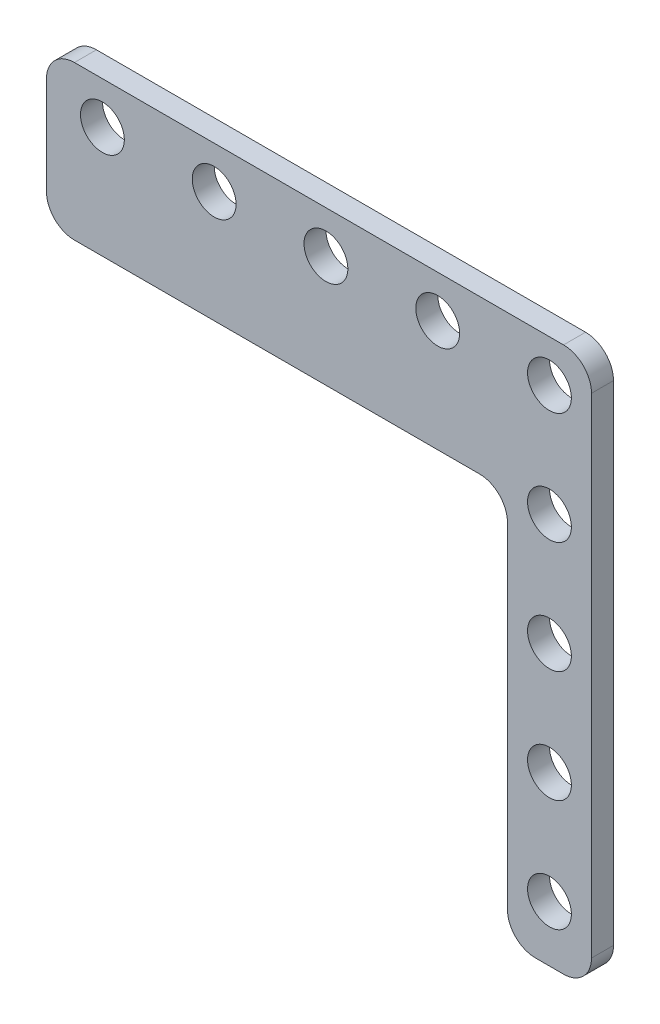
ISO-10303-21;
HEADER;
FILE_DESCRIPTION(('STEP AP214'),'2;1');
FILE_NAME('part.step','',(''),(''),'','','');
FILE_SCHEMA(('AUTOMOTIVE_DESIGN { 1 0 10303 214 1 1 1 1 }'));
ENDSEC;
DATA;
#1=APPLICATION_CONTEXT('core data for automotive mechanical design processes');
#2=APPLICATION_PROTOCOL_DEFINITION('international standard','automotive_design',2000,#1);
#3=PRODUCT_CONTEXT('',#1,'mechanical');
#4=PRODUCT('Part','Part','',(#3));
#5=PRODUCT_RELATED_PRODUCT_CATEGORY('part','',(#4));
#6=PRODUCT_DEFINITION_FORMATION('','',#4);
#7=PRODUCT_DEFINITION_CONTEXT('part definition',#1,'design');
#8=PRODUCT_DEFINITION('design','',#6,#7);
#9=PRODUCT_DEFINITION_SHAPE('','',#8);
#10=(LENGTH_UNIT() NAMED_UNIT(*) SI_UNIT(.MILLI.,.METRE.));
#11=(NAMED_UNIT(*) PLANE_ANGLE_UNIT() SI_UNIT($,.RADIAN.));
#12=(NAMED_UNIT(*) SI_UNIT($,.STERADIAN.) SOLID_ANGLE_UNIT());
#13=UNCERTAINTY_MEASURE_WITH_UNIT(LENGTH_MEASURE(1.E-05),#10,'distance_accuracy_value','');
#14=(GEOMETRIC_REPRESENTATION_CONTEXT(3) GLOBAL_UNCERTAINTY_ASSIGNED_CONTEXT((#13)) GLOBAL_UNIT_ASSIGNED_CONTEXT((#10,
#11,#12)) REPRESENTATION_CONTEXT('',''));
#15=CARTESIAN_POINT('',(0.,0.,0.));
#16=DIRECTION('',(0.,0.,1.));
#17=DIRECTION('',(1.,0.,0.));
#18=AXIS2_PLACEMENT_3D('',#15,#16,#17);
#19=CARTESIAN_POINT('',(17.4752000000032,906.475199999967,1.53492743580445E-13));
#20=DIRECTION('',(0.,1.,0.));
#21=DIRECTION('',(1.,0.,0.));
#22=AXIS2_PLACEMENT_3D('',#19,#20,#21);
#23=PLANE('',#22);
#24=DIRECTION('',(0.,0.,-1.));
#25=VECTOR('',#24,1.);
#26=CARTESIAN_POINT('',(-41.2749999999967,906.475199999967,1.5349987714556E-13));
#27=LINE('',#26,#25);
#28=CARTESIAN_POINT('',(-41.2749999999967,906.475199999967,2.50000000000015));
#29=VERTEX_POINT('',#28);
#30=CARTESIAN_POINT('',(-41.2749999999967,906.475199999967,1.53506279213021E-13));
#31=VERTEX_POINT('',#30);
#32=EDGE_CURVE('E115',#29,#31,#27,.T.);
#33=ORIENTED_EDGE('',*,*,#32,.F.);
#34=DIRECTION('',(-1.,0.,0.));
#35=VECTOR('',#34,1.);
#36=CARTESIAN_POINT('',(17.4752000000032,906.475199999967,2.50000000000015));
#37=LINE('',#36,#35);
#38=CARTESIAN_POINT('',(14.3002000000032,906.475199999967,2.50000000000015));
#39=VERTEX_POINT('',#38);
#40=EDGE_CURVE('E113',#39,#29,#37,.T.);
#41=ORIENTED_EDGE('',*,*,#40,.F.);
#42=DIRECTION('',(0.,0.,1.));
#43=VECTOR('',#42,1.);
#44=CARTESIAN_POINT('',(14.3002000000032,906.475199999967,1.53103754470967E-13));
#45=LINE('',#44,#43);
#46=CARTESIAN_POINT('',(14.3002000000032,906.475199999967,1.53493475078099E-13));
#47=VERTEX_POINT('',#46);
#48=EDGE_CURVE('E11',#47,#39,#45,.T.);
#49=ORIENTED_EDGE('',*,*,#48,.F.);
#50=DIRECTION('',(-1.,0.,0.));
#51=VECTOR('',#50,1.);
#52=CARTESIAN_POINT('',(17.4752000000032,906.475199999967,1.53492743580445E-13));
#53=LINE('',#52,#51);
#54=EDGE_CURVE('E293',#47,#31,#53,.T.);
#55=ORIENTED_EDGE('',*,*,#54,.T.);
#56=EDGE_LOOP('',(#33,#41,#49,#55));
#57=FACE_BOUND('',#56,.T.);
#58=ADVANCED_FACE('F17',(#57),#23,.T.);
#59=CARTESIAN_POINT('',(17.4752000000032,844.549999999967,1.52714765361489E-13));
#60=DIRECTION('',(1.,0.,0.));
#61=DIRECTION('',(0.,1.,0.));
#62=AXIS2_PLACEMENT_3D('',#59,#60,#61);
#63=PLANE('',#62);
#64=DIRECTION('',(0.,0.,1.));
#65=VECTOR('',#64,1.);
#66=CARTESIAN_POINT('',(17.4752000000032,847.724999999967,1.52716778443031E-13));
#67=LINE('',#66,#65);
#68=CARTESIAN_POINT('',(17.4752000000032,847.724999999967,1.52754653498228E-13));
#69=VERTEX_POINT('',#68);
#70=CARTESIAN_POINT('',(17.4752000000032,847.724999999967,2.50000000000015));
#71=VERTEX_POINT('',#70);
#72=EDGE_CURVE('E143',#69,#71,#67,.T.);
#73=ORIENTED_EDGE('',*,*,#72,.F.);
#74=DIRECTION('',(0.,1.,0.));
#75=VECTOR('',#74,1.);
#76=CARTESIAN_POINT('',(17.4752000000032,844.549999999967,1.52714765361489E-13));
#77=LINE('',#76,#75);
#78=CARTESIAN_POINT('',(17.4752000000032,903.300199999967,1.53452855443706E-13));
#79=VERTEX_POINT('',#78);
#80=EDGE_CURVE('E259',#69,#79,#77,.T.);
#81=ORIENTED_EDGE('',*,*,#80,.T.);
#82=DIRECTION('',(0.,0.,-1.));
#83=VECTOR('',#82,1.);
#84=CARTESIAN_POINT('',(17.4752000000032,903.300199999967,1.53103754470967E-13));
#85=LINE('',#84,#83);
#86=CARTESIAN_POINT('',(17.4752000000032,903.300199999967,2.50000000000015));
#87=VERTEX_POINT('',#86);
#88=EDGE_CURVE('E25',#87,#79,#85,.T.);
#89=ORIENTED_EDGE('',*,*,#88,.F.);
#90=DIRECTION('',(0.,1.,0.));
#91=VECTOR('',#90,1.);
#92=CARTESIAN_POINT('',(17.4752000000032,844.549999999967,2.50000000000015));
#93=LINE('',#92,#91);
#94=EDGE_CURVE('E125',#71,#87,#93,.T.);
#95=ORIENTED_EDGE('',*,*,#94,.F.);
#96=EDGE_LOOP('',(#73,#81,#89,#95));
#97=FACE_BOUND('',#96,.T.);
#98=ADVANCED_FACE('F700',(#97),#63,.T.);
#99=CARTESIAN_POINT('',(14.3002000000032,903.300199999967,1.53103754470967E-13));
#100=DIRECTION('',(0.,0.,1.));
#101=DIRECTION('',(0.707106781186552,0.707106781186543,0.));
#102=AXIS2_PLACEMENT_3D('',#99,#100,#101);
#103=CYLINDRICAL_SURFACE('',#102,3.175);
#104=CARTESIAN_POINT('',(14.3002000000032,903.300199999967,2.50000000000015));
#105=DIRECTION('',(0.,0.,-1.));
#106=DIRECTION('',(0.707106781186552,0.707106781186543,0.));
#107=AXIS2_PLACEMENT_3D('',#104,#105,#106);
#108=CIRCLE('',#107,3.175);
#109=EDGE_CURVE('E105',#39,#87,#108,.T.);
#110=ORIENTED_EDGE('',*,*,#109,.T.);
#111=ORIENTED_EDGE('',*,*,#88,.T.);
#112=CARTESIAN_POINT('',(14.3002000000032,903.300199999967,1.53110888036082E-13));
#113=DIRECTION('',(0.,0.,1.));
#114=DIRECTION('',(0.707106781186552,0.707106781186543,0.));
#115=AXIS2_PLACEMENT_3D('',#112,#113,#114);
#116=CIRCLE('',#115,3.175);
#117=EDGE_CURVE('E108',#79,#47,#116,.T.);
#118=ORIENTED_EDGE('',*,*,#117,.T.);
#119=ORIENTED_EDGE('',*,*,#48,.T.);
#120=EDGE_LOOP('',(#110,#111,#118,#119));
#121=FACE_BOUND('',#120,.T.);
#122=ADVANCED_FACE('F103',(#121),#103,.T.);
#123=CARTESIAN_POINT('',(-41.2749999999967,903.300199999967,1.5349987714556E-13));
#124=DIRECTION('',(0.,0.,1.));
#125=DIRECTION('',(-0.707106781186552,0.707106781186543,0.));
#126=AXIS2_PLACEMENT_3D('',#123,#124,#125);
#127=CYLINDRICAL_SURFACE('',#126,3.175);
#128=CARTESIAN_POINT('',(-41.2749999999967,903.300199999967,2.50000000000015));
#129=DIRECTION('',(0.,0.,-1.));
#130=DIRECTION('',(-0.707106781186552,0.707106781186543,0.));
#131=AXIS2_PLACEMENT_3D('',#128,#129,#130);
#132=CIRCLE('',#131,3.175);
#133=CARTESIAN_POINT('',(-44.4499999999967,903.300199999967,2.50000000000015));
#134=VERTEX_POINT('',#133);
#135=EDGE_CURVE('E119',#134,#29,#132,.T.);
#136=ORIENTED_EDGE('',*,*,#135,.T.);
#137=ORIENTED_EDGE('',*,*,#32,.T.);
#138=CARTESIAN_POINT('',(-41.2749999999967,903.300199999967,1.53110888036082E-13));
#139=DIRECTION('',(0.,0.,1.));
#140=DIRECTION('',(-0.707106781186552,0.707106781186543,0.));
#141=AXIS2_PLACEMENT_3D('',#138,#139,#140);
#142=CIRCLE('',#141,3.175);
#143=CARTESIAN_POINT('',(-44.4499999999967,903.300199999967,1.53467122573935E-13));
#144=VERTEX_POINT('',#143);
#145=EDGE_CURVE('E290',#31,#144,#142,.T.);
#146=ORIENTED_EDGE('',*,*,#145,.T.);
#147=DIRECTION('',(0.,0.,1.));
#148=VECTOR('',#147,1.);
#149=CARTESIAN_POINT('',(-44.4499999999967,903.300199999967,1.5349987714556E-13));
#150=LINE('',#149,#148);
#151=EDGE_CURVE('E50',#144,#134,#150,.T.);
#152=ORIENTED_EDGE('',*,*,#151,.T.);
#153=EDGE_LOOP('',(#136,#137,#146,#152));
#154=FACE_BOUND('',#153,.T.);
#155=ADVANCED_FACE('F756',(#154),#127,.T.);
#156=CARTESIAN_POINT('',(-44.4499999999967,906.475199999967,1.53507010710674E-13));
#157=DIRECTION('',(-1.,0.,0.));
#158=DIRECTION('',(0.,0.,1.));
#159=AXIS2_PLACEMENT_3D('',#156,#157,#158);
#160=PLANE('',#159);
#161=DIRECTION('',(0.,0.,-1.));
#162=VECTOR('',#161,1.);
#163=CARTESIAN_POINT('',(-44.4499999999967,892.174999999967,1.53397238558369E-13));
#164=LINE('',#163,#162);
#165=CARTESIAN_POINT('',(-44.4499999999967,892.174999999967,2.50000000000015));
#166=VERTEX_POINT('',#165);
#167=CARTESIAN_POINT('',(-44.4499999999967,892.174999999967,1.53327354542802E-13));
#168=VERTEX_POINT('',#167);
#169=EDGE_CURVE('E37',#166,#168,#164,.T.);
#170=ORIENTED_EDGE('',*,*,#169,.F.);
#171=DIRECTION('',(0.,-1.,0.));
#172=VECTOR('',#171,1.);
#173=CARTESIAN_POINT('',(-44.4499999999967,906.475199999967,2.50000000000015));
#174=LINE('',#173,#172);
#175=EDGE_CURVE('E136',#134,#166,#174,.T.);
#176=ORIENTED_EDGE('',*,*,#175,.F.);
#177=ORIENTED_EDGE('',*,*,#151,.F.);
#178=DIRECTION('',(0.,-1.,0.));
#179=VECTOR('',#178,1.);
#180=CARTESIAN_POINT('',(-44.4499999999967,906.475199999967,1.53507010710674E-13));
#181=LINE('',#180,#179);
#182=EDGE_CURVE('E287',#144,#168,#181,.T.);
#183=ORIENTED_EDGE('',*,*,#182,.T.);
#184=EDGE_LOOP('',(#170,#176,#177,#183));
#185=FACE_BOUND('',#184,.T.);
#186=ADVANCED_FACE('F748',(#185),#160,.T.);
#187=CARTESIAN_POINT('',(-41.2749999999967,892.174999999967,1.53397238558369E-13));
#188=DIRECTION('',(0.,0.,1.));
#189=DIRECTION('',(-0.707106781186552,-0.707106781186543,0.));
#190=AXIS2_PLACEMENT_3D('',#187,#188,#189);
#191=CYLINDRICAL_SURFACE('',#190,3.175);
#192=CARTESIAN_POINT('',(-41.2749999999967,892.174999999967,2.50000000000015));
#193=DIRECTION('',(0.,0.,-1.));
#194=DIRECTION('',(-0.707106781186552,-0.707106781186543,0.));
#195=AXIS2_PLACEMENT_3D('',#192,#193,#194);
#196=CIRCLE('',#195,3.175);
#197=CARTESIAN_POINT('',(-41.2749999999967,888.999999999967,2.50000000000015));
#198=VERTEX_POINT('',#197);
#199=EDGE_CURVE('E140',#198,#166,#196,.T.);
#200=ORIENTED_EDGE('',*,*,#199,.T.);
#201=ORIENTED_EDGE('',*,*,#169,.T.);
#202=CARTESIAN_POINT('',(-41.2749999999967,892.174999999967,1.53110888036082E-13));
#203=DIRECTION('',(0.,0.,1.));
#204=DIRECTION('',(-0.707106781186552,-0.707106781186543,0.));
#205=AXIS2_PLACEMENT_3D('',#202,#203,#204);
#206=CIRCLE('',#205,3.175);
#207=CARTESIAN_POINT('',(-41.2749999999967,888.999999999967,1.5328673490841E-13));
#208=VERTEX_POINT('',#207);
#209=EDGE_CURVE('E286',#168,#208,#206,.T.);
#210=ORIENTED_EDGE('',*,*,#209,.T.);
#211=DIRECTION('',(0.,0.,1.));
#212=VECTOR('',#211,1.);
#213=CARTESIAN_POINT('',(-41.2749999999967,888.999999999967,1.53397238558369E-13));
#214=LINE('',#213,#212);
#215=EDGE_CURVE('E164',#208,#198,#214,.T.);
#216=ORIENTED_EDGE('',*,*,#215,.T.);
#217=EDGE_LOOP('',(#200,#201,#210,#216));
#218=FACE_BOUND('',#217,.T.);
#219=ADVANCED_FACE('F739',(#218),#191,.T.);
#220=CARTESIAN_POINT('',(14.3002000000032,847.724999999967,1.52716778443031E-13));
#221=DIRECTION('',(0.,0.,1.));
#222=DIRECTION('',(0.707106781186552,-0.707106781186543,0.));
#223=AXIS2_PLACEMENT_3D('',#220,#221,#222);
#224=CYLINDRICAL_SURFACE('',#223,3.175);
#225=CARTESIAN_POINT('',(14.3002000000032,847.724999999967,2.50000000000015));
#226=DIRECTION('',(0.,0.,-1.));
#227=DIRECTION('',(0.707106781186552,-0.707106781186543,0.));
#228=AXIS2_PLACEMENT_3D('',#225,#226,#227);
#229=CIRCLE('',#228,3.175);
#230=CARTESIAN_POINT('',(14.3002000000032,844.549999999967,2.50000000000015));
#231=VERTEX_POINT('',#230);
#232=EDGE_CURVE('E132',#71,#231,#229,.T.);
#233=ORIENTED_EDGE('',*,*,#232,.T.);
#234=DIRECTION('',(0.,0.,-1.));
#235=VECTOR('',#234,1.);
#236=CARTESIAN_POINT('',(14.3002000000032,844.549999999967,1.52716778443031E-13));
#237=LINE('',#236,#235);
#238=CARTESIAN_POINT('',(14.3002000000032,844.549999999967,1.52715496859142E-13));
#239=VERTEX_POINT('',#238);
#240=EDGE_CURVE('E141',#231,#239,#237,.T.);
#241=ORIENTED_EDGE('',*,*,#240,.T.);
#242=CARTESIAN_POINT('',(14.3002000000032,847.724999999967,1.53110888036082E-13));
#243=DIRECTION('',(0.,0.,1.));
#244=DIRECTION('',(0.707106781186552,-0.707106781186543,0.));
#245=AXIS2_PLACEMENT_3D('',#242,#243,#244);
#246=CIRCLE('',#245,3.175);
#247=EDGE_CURVE('E254',#239,#69,#246,.T.);
#248=ORIENTED_EDGE('',*,*,#247,.T.);
#249=ORIENTED_EDGE('',*,*,#72,.T.);
#250=EDGE_LOOP('',(#233,#241,#248,#249));
#251=FACE_BOUND('',#250,.T.);
#252=ADVANCED_FACE('F730',(#251),#224,.T.);
#253=CARTESIAN_POINT('',(3.0975222387042E-12,844.549999999967,1.52718791524573E-13));
#254=DIRECTION('',(0.,-1.,0.));
#255=DIRECTION('',(0.,0.,-1.));
#256=AXIS2_PLACEMENT_3D('',#253,#254,#255);
#257=PLANE('',#256);
#258=DIRECTION('',(0.,0.,1.));
#259=VECTOR('',#258,1.);
#260=CARTESIAN_POINT('',(11.0998000000031,844.549999999967,1.25000000000015));
#261=LINE('',#260,#259);
#262=CARTESIAN_POINT('',(11.0998000000031,844.549999999967,1.52716234208777E-13));
#263=VERTEX_POINT('',#262);
#264=CARTESIAN_POINT('',(11.0998000000031,844.549999999967,2.50000000000015));
#265=VERTEX_POINT('',#264);
#266=EDGE_CURVE('E266',#263,#265,#261,.T.);
#267=ORIENTED_EDGE('',*,*,#266,.F.);
#268=DIRECTION('',(1.,0.,0.));
#269=VECTOR('',#268,1.);
#270=CARTESIAN_POINT('',(3.0975222387042E-12,844.549999999967,1.52718791524573E-13));
#271=LINE('',#270,#269);
#272=EDGE_CURVE('E258',#263,#239,#271,.T.);
#273=ORIENTED_EDGE('',*,*,#272,.T.);
#274=ORIENTED_EDGE('',*,*,#240,.F.);
#275=DIRECTION('',(1.,0.,0.));
#276=VECTOR('',#275,1.);
#277=CARTESIAN_POINT('',(3.0975222387042E-12,844.549999999967,2.50000000000015));
#278=LINE('',#277,#276);
#279=EDGE_CURVE('E161',#265,#231,#278,.T.);
#280=ORIENTED_EDGE('',*,*,#279,.F.);
#281=EDGE_LOOP('',(#267,#273,#274,#280));
#282=FACE_BOUND('',#281,.T.);
#283=ADVANCED_FACE('F715',(#282),#257,.T.);
#284=CARTESIAN_POINT('',(-13.4873999999968,875.512599999967,2.50000000000015));
#285=DIRECTION('',(0.,0.,1.));
#286=DIRECTION('',(1.,0.,0.));
#287=AXIS2_PLACEMENT_3D('',#284,#285,#286);
#288=PLANE('',#287);
#289=CARTESIAN_POINT('',(-38.0999999999977,901.699999999967,2.50000000000015));
#290=DIRECTION('',(0.,0.,-1.));
#291=DIRECTION('',(1.,0.,0.));
#292=AXIS2_PLACEMENT_3D('',#289,#290,#291);
#293=CIRCLE('',#292,2.4892);
#294=CARTESIAN_POINT('',(-40.5891999999977,901.699999999967,2.50000000000015));
#295=VERTEX_POINT('',#294);
#296=EDGE_CURVE('E190',#295,#295,#293,.T.);
#297=ORIENTED_EDGE('',*,*,#296,.T.);
#298=EDGE_LOOP('',(#297));
#299=FACE_BOUND('',#298,.T.);
#300=CARTESIAN_POINT('',(12.7000000000032,901.699999999967,2.50000000000015));
#301=DIRECTION('',(0.,0.,-1.));
#302=DIRECTION('',(1.,0.,0.));
#303=AXIS2_PLACEMENT_3D('',#300,#301,#302);
#304=CIRCLE('',#303,2.4892);
#305=CARTESIAN_POINT('',(10.2108000000032,901.699999999967,2.50000000000015));
#306=VERTEX_POINT('',#305);
#307=EDGE_CURVE('E242',#306,#306,#304,.T.);
#308=ORIENTED_EDGE('',*,*,#307,.T.);
#309=EDGE_LOOP('',(#308));
#310=FACE_BOUND('',#309,.T.);
#311=CARTESIAN_POINT('',(12.700000000003,850.89999999997,2.50000000000015));
#312=DIRECTION('',(0.,0.,-1.));
#313=DIRECTION('',(1.,0.,0.));
#314=AXIS2_PLACEMENT_3D('',#311,#312,#313);
#315=CIRCLE('',#314,2.4892);
#316=CARTESIAN_POINT('',(10.210800000003,850.89999999997,2.50000000000015));
#317=VERTEX_POINT('',#316);
#318=EDGE_CURVE('E228',#317,#317,#315,.T.);
#319=ORIENTED_EDGE('',*,*,#318,.T.);
#320=EDGE_LOOP('',(#319));
#321=FACE_BOUND('',#320,.T.);
#322=CARTESIAN_POINT('',(12.7000000000032,888.999999999967,2.50000000000015));
#323=DIRECTION('',(0.,0.,-1.));
#324=DIRECTION('',(1.,0.,0.));
#325=AXIS2_PLACEMENT_3D('',#322,#323,#324);
#326=CIRCLE('',#325,2.4892);
#327=CARTESIAN_POINT('',(10.2108000000032,888.999999999967,2.50000000000015));
#328=VERTEX_POINT('',#327);
#329=EDGE_CURVE('E207',#328,#328,#326,.T.);
#330=ORIENTED_EDGE('',*,*,#329,.T.);
#331=EDGE_LOOP('',(#330));
#332=FACE_BOUND('',#331,.T.);
#333=CARTESIAN_POINT('',(-25.3999999999976,901.699999999967,2.50000000000015));
#334=DIRECTION('',(0.,0.,-1.));
#335=DIRECTION('',(1.,0.,0.));
#336=AXIS2_PLACEMENT_3D('',#333,#334,#335);
#337=CIRCLE('',#336,2.4892);
#338=CARTESIAN_POINT('',(-27.8891999999977,901.699999999967,2.50000000000015));
#339=VERTEX_POINT('',#338);
#340=EDGE_CURVE('E206',#339,#339,#337,.T.);
#341=ORIENTED_EDGE('',*,*,#340,.T.);
#342=EDGE_LOOP('',(#341));
#343=FACE_BOUND('',#342,.T.);
#344=CARTESIAN_POINT('',(3.29514193708748E-12,901.699999999967,2.50000000000015));
#345=DIRECTION('',(0.,0.,-1.));
#346=DIRECTION('',(1.,0.,0.));
#347=AXIS2_PLACEMENT_3D('',#344,#345,#346);
#348=CIRCLE('',#347,2.4892);
#349=CARTESIAN_POINT('',(-2.4891999999967,901.699999999967,2.50000000000015));
#350=VERTEX_POINT('',#349);
#351=EDGE_CURVE('E195',#350,#350,#348,.T.);
#352=ORIENTED_EDGE('',*,*,#351,.T.);
#353=EDGE_LOOP('',(#352));
#354=FACE_BOUND('',#353,.T.);
#355=CARTESIAN_POINT('',(12.7000000000031,863.59999999997,2.50000000000015));
#356=DIRECTION('',(0.,0.,-1.));
#357=DIRECTION('',(1.,0.,0.));
#358=AXIS2_PLACEMENT_3D('',#355,#356,#357);
#359=CIRCLE('',#358,2.4892);
#360=CARTESIAN_POINT('',(10.2108000000031,863.59999999997,2.50000000000015));
#361=VERTEX_POINT('',#360);
#362=EDGE_CURVE('E376',#361,#361,#359,.T.);
#363=ORIENTED_EDGE('',*,*,#362,.T.);
#364=EDGE_LOOP('',(#363));
#365=FACE_BOUND('',#364,.T.);
#366=CARTESIAN_POINT('',(12.7000000000031,876.299999999969,2.50000000000015));
#367=DIRECTION('',(0.,0.,-1.));
#368=DIRECTION('',(1.,0.,0.));
#369=AXIS2_PLACEMENT_3D('',#366,#367,#368);
#370=CIRCLE('',#369,2.4892);
#371=CARTESIAN_POINT('',(10.2108000000031,876.299999999969,2.50000000000015));
#372=VERTEX_POINT('',#371);
#373=EDGE_CURVE('E354',#372,#372,#370,.T.);
#374=ORIENTED_EDGE('',*,*,#373,.T.);
#375=EDGE_LOOP('',(#374));
#376=FACE_BOUND('',#375,.T.);
#377=CARTESIAN_POINT('',(-12.699999999997,901.699999999967,2.50000000000015));
#378=DIRECTION('',(0.,0.,-1.));
#379=DIRECTION('',(1.,0.,0.));
#380=AXIS2_PLACEMENT_3D('',#377,#378,#379);
#381=CIRCLE('',#380,2.4892);
#382=CARTESIAN_POINT('',(-15.189199999997,901.699999999967,2.50000000000015));
#383=VERTEX_POINT('',#382);
#384=EDGE_CURVE('E363',#383,#383,#381,.T.);
#385=ORIENTED_EDGE('',*,*,#384,.T.);
#386=EDGE_LOOP('',(#385));
#387=FACE_BOUND('',#386,.T.);
#388=CARTESIAN_POINT('',(11.0998000000031,847.724999999967,2.50000000000015));
#389=DIRECTION('',(0.,0.,-1.));
#390=DIRECTION('',(-0.707106781186552,-0.707106781186543,0.));
#391=AXIS2_PLACEMENT_3D('',#388,#389,#390);
#392=CIRCLE('',#391,3.175);
#393=CARTESIAN_POINT('',(7.92480000000315,847.724999999967,2.50000000000015));
#394=VERTEX_POINT('',#393);
#395=EDGE_CURVE('E270',#265,#394,#392,.T.);
#396=ORIENTED_EDGE('',*,*,#395,.F.);
#397=ORIENTED_EDGE('',*,*,#279,.T.);
#398=ORIENTED_EDGE('',*,*,#232,.F.);
#399=ORIENTED_EDGE('',*,*,#94,.T.);
#400=ORIENTED_EDGE('',*,*,#109,.F.);
#401=ORIENTED_EDGE('',*,*,#40,.T.);
#402=ORIENTED_EDGE('',*,*,#135,.F.);
#403=ORIENTED_EDGE('',*,*,#175,.T.);
#404=ORIENTED_EDGE('',*,*,#199,.F.);
#405=DIRECTION('',(1.,0.,0.));
#406=VECTOR('',#405,1.);
#407=CARTESIAN_POINT('',(-6.74369999999683,888.999999999967,2.50000000000015));
#408=LINE('',#407,#406);
#409=CARTESIAN_POINT('',(4.74980000000315,888.999999999967,2.50000000000015));
#410=VERTEX_POINT('',#409);
#411=EDGE_CURVE('E173',#198,#410,#408,.T.);
#412=ORIENTED_EDGE('',*,*,#411,.T.);
#413=CARTESIAN_POINT('',(4.74980000000315,885.824999999967,2.50000000000015));
#414=DIRECTION('',(0.,0.,1.));
#415=DIRECTION('',(0.707106781186554,0.707106781186542,0.));
#416=AXIS2_PLACEMENT_3D('',#413,#414,#415);
#417=CIRCLE('',#416,3.175);
#418=CARTESIAN_POINT('',(7.92480000000315,885.824999999967,2.50000000000015));
#419=VERTEX_POINT('',#418);
#420=EDGE_CURVE('E311',#419,#410,#417,.T.);
#421=ORIENTED_EDGE('',*,*,#420,.F.);
#422=DIRECTION('',(0.,-1.,0.));
#423=VECTOR('',#422,1.);
#424=CARTESIAN_POINT('',(7.92480000000315,882.256299999967,2.50000000000015));
#425=LINE('',#424,#423);
#426=EDGE_CURVE('E304',#419,#394,#425,.T.);
#427=ORIENTED_EDGE('',*,*,#426,.T.);
#428=EDGE_LOOP('',(#396,#397,#398,#399,#400,#401,#402,#403,#404,#412,#421,#427));
#429=FACE_BOUND('',#428,.T.);
#430=ADVANCED_FACE('F122',(#299,#310,#321,#332,#343,#354,#365,#376,#387,#429),#288,.T.);
#431=CARTESIAN_POINT('',(-44.4499999999967,888.999999999967,1.53287466406063E-13));
#432=DIRECTION('',(0.,-1.,0.));
#433=DIRECTION('',(-1.,0.,0.));
#434=AXIS2_PLACEMENT_3D('',#431,#432,#433);
#435=PLANE('',#434);
#436=DIRECTION('',(0.,0.,-1.));
#437=VECTOR('',#436,1.);
#438=CARTESIAN_POINT('',(4.74980000000315,888.999999999967,1.25000000000015));
#439=LINE('',#438,#437);
#440=CARTESIAN_POINT('',(4.74980000000315,888.999999999967,1.53208129376766E-13));
#441=VERTEX_POINT('',#440);
#442=EDGE_CURVE('E159',#410,#441,#439,.T.);
#443=ORIENTED_EDGE('',*,*,#442,.F.);
#444=ORIENTED_EDGE('',*,*,#411,.F.);
#445=ORIENTED_EDGE('',*,*,#215,.F.);
#446=DIRECTION('',(-1.,0.,0.));
#447=VECTOR('',#446,1.);
#448=CARTESIAN_POINT('',(-6.74369999999683,888.999999999967,1.53210777398272E-13));
#449=LINE('',#448,#447);
#450=EDGE_CURVE('E280',#441,#208,#449,.T.);
#451=ORIENTED_EDGE('',*,*,#450,.F.);
#452=EDGE_LOOP('',(#443,#444,#445,#451));
#453=FACE_BOUND('',#452,.T.);
#454=ADVANCED_FACE('F332',(#453),#435,.T.);
#455=CARTESIAN_POINT('',(4.74980000000315,885.824999999967,1.25000000000015));
#456=DIRECTION('',(0.,0.,-1.));
#457=DIRECTION('',(0.707106781186554,0.707106781186542,0.));
#458=AXIS2_PLACEMENT_3D('',#455,#456,#457);
#459=CYLINDRICAL_SURFACE('',#458,3.175);
#460=ORIENTED_EDGE('',*,*,#420,.T.);
#461=ORIENTED_EDGE('',*,*,#442,.T.);
#462=CARTESIAN_POINT('',(4.74980000000315,885.824999999967,1.53071999520194E-13));
#463=DIRECTION('',(0.,0.,-1.));
#464=DIRECTION('',(0.707106781186554,0.707106781186542,0.));
#465=AXIS2_PLACEMENT_3D('',#462,#463,#464);
#466=CIRCLE('',#465,3.175);
#467=CARTESIAN_POINT('',(7.92480000000315,885.824999999967,1.53255611663966E-13));
#468=VERTEX_POINT('',#467);
#469=EDGE_CURVE('E276',#441,#468,#466,.T.);
#470=ORIENTED_EDGE('',*,*,#469,.T.);
#471=DIRECTION('',(0.,0.,1.));
#472=VECTOR('',#471,1.);
#473=CARTESIAN_POINT('',(7.92480000000315,885.824999999967,1.25000000000015));
#474=LINE('',#473,#472);
#475=EDGE_CURVE('E308',#468,#419,#474,.T.);
#476=ORIENTED_EDGE('',*,*,#475,.T.);
#477=EDGE_LOOP('',(#460,#461,#470,#476));
#478=FACE_BOUND('',#477,.T.);
#479=ADVANCED_FACE('F324',(#478),#459,.F.);
#480=CARTESIAN_POINT('',(7.92480000000315,888.999999999967,2.50000000000015));
#481=DIRECTION('',(1.,0.,0.));
#482=DIRECTION('',(0.,1.,0.));
#483=AXIS2_PLACEMENT_3D('',#480,#481,#482);
#484=PLANE('',#483);
#485=DIRECTION('',(0.,0.,-1.));
#486=VECTOR('',#485,1.);
#487=CARTESIAN_POINT('',(7.92480000000315,847.724999999967,1.25000000000015));
#488=LINE('',#487,#486);
#489=CARTESIAN_POINT('',(7.92480000000315,847.724999999967,1.52776954023099E-13));
#490=VERTEX_POINT('',#489);
#491=EDGE_CURVE('E271',#394,#490,#488,.T.);
#492=ORIENTED_EDGE('',*,*,#491,.F.);
#493=ORIENTED_EDGE('',*,*,#426,.F.);
#494=ORIENTED_EDGE('',*,*,#475,.F.);
#495=DIRECTION('',(0.,1.,0.));
#496=VECTOR('',#495,1.);
#497=CARTESIAN_POINT('',(7.92480000000315,882.256299999967,1.53210777398272E-13));
#498=LINE('',#497,#496);
#499=EDGE_CURVE('E275',#490,#468,#498,.T.);
#500=ORIENTED_EDGE('',*,*,#499,.F.);
#501=EDGE_LOOP('',(#492,#493,#494,#500));
#502=FACE_BOUND('',#501,.T.);
#503=ADVANCED_FACE('F408',(#502),#484,.F.);
#504=CARTESIAN_POINT('',(-13.4873999999968,875.512599999967,1.53110888036082E-13));
#505=DIRECTION('',(0.,0.,1.));
#506=DIRECTION('',(0.,-1.,0.));
#507=AXIS2_PLACEMENT_3D('',#504,#505,#506);
#508=PLANE('',#507);
#509=CARTESIAN_POINT('',(-38.0999999999977,901.699999999967,1.53210777398272E-13));
#510=DIRECTION('',(0.,0.,1.));
#511=DIRECTION('',(1.,0.,0.));
#512=AXIS2_PLACEMENT_3D('',#509,#510,#511);
#513=CIRCLE('',#512,2.4892);
#514=CARTESIAN_POINT('',(-40.5891999999977,901.699999999967,1.53210777398272E-13));
#515=VERTEX_POINT('',#514);
#516=EDGE_CURVE('E189',#515,#515,#513,.T.);
#517=ORIENTED_EDGE('',*,*,#516,.T.);
#518=EDGE_LOOP('',(#517));
#519=FACE_BOUND('',#518,.T.);
#520=CARTESIAN_POINT('',(12.7000000000032,901.699999999967,1.53210777398272E-13));
#521=DIRECTION('',(0.,0.,1.));
#522=DIRECTION('',(1.,0.,0.));
#523=AXIS2_PLACEMENT_3D('',#520,#521,#522);
#524=CIRCLE('',#523,2.4892);
#525=CARTESIAN_POINT('',(10.2108000000032,901.699999999967,1.53210777398272E-13));
#526=VERTEX_POINT('',#525);
#527=EDGE_CURVE('E250',#526,#526,#524,.T.);
#528=ORIENTED_EDGE('',*,*,#527,.T.);
#529=EDGE_LOOP('',(#528));
#530=FACE_BOUND('',#529,.T.);
#531=CARTESIAN_POINT('',(12.700000000003,850.89999999997,1.53210777398272E-13));
#532=DIRECTION('',(0.,0.,1.));
#533=DIRECTION('',(1.,0.,0.));
#534=AXIS2_PLACEMENT_3D('',#531,#532,#533);
#535=CIRCLE('',#534,2.4892);
#536=CARTESIAN_POINT('',(10.210800000003,850.89999999997,1.53210777398272E-13));
#537=VERTEX_POINT('',#536);
#538=EDGE_CURVE('E236',#537,#537,#535,.T.);
#539=ORIENTED_EDGE('',*,*,#538,.T.);
#540=EDGE_LOOP('',(#539));
#541=FACE_BOUND('',#540,.T.);
#542=CARTESIAN_POINT('',(12.7000000000032,888.999999999967,1.53210777398272E-13));
#543=DIRECTION('',(0.,0.,1.));
#544=DIRECTION('',(1.,0.,0.));
#545=AXIS2_PLACEMENT_3D('',#542,#543,#544);
#546=CIRCLE('',#545,2.4892);
#547=CARTESIAN_POINT('',(10.2108000000032,888.999999999967,1.53210777398272E-13));
#548=VERTEX_POINT('',#547);
#549=EDGE_CURVE('E224',#548,#548,#546,.T.);
#550=ORIENTED_EDGE('',*,*,#549,.T.);
#551=EDGE_LOOP('',(#550));
#552=FACE_BOUND('',#551,.T.);
#553=CARTESIAN_POINT('',(-25.3999999999976,901.699999999967,1.53210777398272E-13));
#554=DIRECTION('',(0.,0.,1.));
#555=DIRECTION('',(1.,0.,0.));
#556=AXIS2_PLACEMENT_3D('',#553,#554,#555);
#557=CIRCLE('',#556,2.4892);
#558=CARTESIAN_POINT('',(-27.8891999999977,901.699999999967,1.53210777398272E-13));
#559=VERTEX_POINT('',#558);
#560=EDGE_CURVE('E205',#559,#559,#557,.T.);
#561=ORIENTED_EDGE('',*,*,#560,.T.);
#562=EDGE_LOOP('',(#561));
#563=FACE_BOUND('',#562,.T.);
#564=CARTESIAN_POINT('',(3.29514193708748E-12,901.699999999967,1.53210777398272E-13));
#565=DIRECTION('',(0.,0.,1.));
#566=DIRECTION('',(1.,0.,0.));
#567=AXIS2_PLACEMENT_3D('',#564,#565,#566);
#568=CIRCLE('',#567,2.4892);
#569=CARTESIAN_POINT('',(-2.4891999999967,901.699999999967,1.53210777398272E-13));
#570=VERTEX_POINT('',#569);
#571=EDGE_CURVE('E200',#570,#570,#568,.T.);
#572=ORIENTED_EDGE('',*,*,#571,.T.);
#573=EDGE_LOOP('',(#572));
#574=FACE_BOUND('',#573,.T.);
#575=CARTESIAN_POINT('',(12.7000000000031,863.59999999997,1.53210777398272E-13));
#576=DIRECTION('',(0.,0.,1.));
#577=DIRECTION('',(1.,0.,0.));
#578=AXIS2_PLACEMENT_3D('',#575,#576,#577);
#579=CIRCLE('',#578,2.4892);
#580=CARTESIAN_POINT('',(10.2108000000031,863.59999999997,1.53210777398272E-13));
#581=VERTEX_POINT('',#580);
#582=EDGE_CURVE('E191',#581,#581,#579,.T.);
#583=ORIENTED_EDGE('',*,*,#582,.T.);
#584=EDGE_LOOP('',(#583));
#585=FACE_BOUND('',#584,.T.);
#586=CARTESIAN_POINT('',(12.7000000000031,876.299999999969,1.53210777398272E-13));
#587=DIRECTION('',(0.,0.,1.));
#588=DIRECTION('',(1.,0.,0.));
#589=AXIS2_PLACEMENT_3D('',#586,#587,#588);
#590=CIRCLE('',#589,2.4892);
#591=CARTESIAN_POINT('',(10.2108000000031,876.299999999969,1.53210777398272E-13));
#592=VERTEX_POINT('',#591);
#593=EDGE_CURVE('E372',#592,#592,#590,.T.);
#594=ORIENTED_EDGE('',*,*,#593,.T.);
#595=EDGE_LOOP('',(#594));
#596=FACE_BOUND('',#595,.T.);
#597=CARTESIAN_POINT('',(-12.699999999997,901.699999999967,1.53210777398272E-13));
#598=DIRECTION('',(0.,0.,1.));
#599=DIRECTION('',(1.,0.,0.));
#600=AXIS2_PLACEMENT_3D('',#597,#598,#599);
#601=CIRCLE('',#600,2.4892);
#602=CARTESIAN_POINT('',(-15.189199999997,901.699999999967,1.53210777398272E-13));
#603=VERTEX_POINT('',#602);
#604=EDGE_CURVE('E358',#603,#603,#601,.T.);
#605=ORIENTED_EDGE('',*,*,#604,.T.);
#606=EDGE_LOOP('',(#605));
#607=FACE_BOUND('',#606,.T.);
#608=CARTESIAN_POINT('',(11.0998000000031,847.724999999967,1.53071999520194E-13));
#609=DIRECTION('',(0.,0.,1.));
#610=DIRECTION('',(-0.707106781186552,-0.707106781186543,0.));
#611=AXIS2_PLACEMENT_3D('',#608,#609,#610);
#612=CIRCLE('',#611,3.175);
#613=EDGE_CURVE('E220',#490,#263,#612,.T.);
#614=ORIENTED_EDGE('',*,*,#613,.F.);
#615=ORIENTED_EDGE('',*,*,#499,.T.);
#616=ORIENTED_EDGE('',*,*,#469,.F.);
#617=ORIENTED_EDGE('',*,*,#450,.T.);
#618=ORIENTED_EDGE('',*,*,#209,.F.);
#619=ORIENTED_EDGE('',*,*,#182,.F.);
#620=ORIENTED_EDGE('',*,*,#145,.F.);
#621=ORIENTED_EDGE('',*,*,#54,.F.);
#622=ORIENTED_EDGE('',*,*,#117,.F.);
#623=ORIENTED_EDGE('',*,*,#80,.F.);
#624=ORIENTED_EDGE('',*,*,#247,.F.);
#625=ORIENTED_EDGE('',*,*,#272,.F.);
#626=EDGE_LOOP('',(#614,#615,#616,#617,#618,#619,#620,#621,#622,#623,#624,#625));
#627=FACE_BOUND('',#626,.T.);
#628=ADVANCED_FACE('F336',(#519,#530,#541,#552,#563,#574,#585,#596,#607,#627),#508,.F.);
#629=CARTESIAN_POINT('',(11.0998000000031,847.724999999967,1.25000000000015));
#630=DIRECTION('',(0.,0.,-1.));
#631=DIRECTION('',(-0.707106781186552,-0.707106781186543,0.));
#632=AXIS2_PLACEMENT_3D('',#629,#630,#631);
#633=CYLINDRICAL_SURFACE('',#632,3.175);
#634=ORIENTED_EDGE('',*,*,#613,.T.);
#635=ORIENTED_EDGE('',*,*,#266,.T.);
#636=ORIENTED_EDGE('',*,*,#395,.T.);
#637=ORIENTED_EDGE('',*,*,#491,.T.);
#638=EDGE_LOOP('',(#634,#635,#636,#637));
#639=FACE_BOUND('',#638,.T.);
#640=ADVANCED_FACE('F407',(#639),#633,.T.);
#641=CARTESIAN_POINT('',(-38.0999999999977,901.699999999967,2.50000000000015));
#642=DIRECTION('',(0.,0.,-1.));
#643=DIRECTION('',(1.,0.,0.));
#644=AXIS2_PLACEMENT_3D('',#641,#642,#643);
#645=CYLINDRICAL_SURFACE('',#644,2.4892);
#646=ORIENTED_EDGE('',*,*,#296,.F.);
#647=DIRECTION('',(0.,0.,-1.));
#648=VECTOR('',#647,1.);
#649=CARTESIAN_POINT('',(-40.5891999999977,901.699999999967,2.50000000000015));
#650=LINE('',#649,#648);
#651=EDGE_CURVE('E185',#295,#515,#650,.T.);
#652=ORIENTED_EDGE('',*,*,#651,.T.);
#653=ORIENTED_EDGE('',*,*,#516,.F.);
#654=ORIENTED_EDGE('',*,*,#651,.F.);
#655=EDGE_LOOP('',(#646,#652,#653,#654));
#656=FACE_BOUND('',#655,.T.);
#657=ADVANCED_FACE('F596',(#656),#645,.F.);
#658=CARTESIAN_POINT('',(12.7000000000032,901.699999999967,2.50000000000015));
#659=DIRECTION('',(0.,0.,-1.));
#660=DIRECTION('',(1.,0.,0.));
#661=AXIS2_PLACEMENT_3D('',#658,#659,#660);
#662=CYLINDRICAL_SURFACE('',#661,2.4892);
#663=ORIENTED_EDGE('',*,*,#307,.F.);
#664=DIRECTION('',(0.,0.,-1.));
#665=VECTOR('',#664,1.);
#666=CARTESIAN_POINT('',(10.2108000000032,901.699999999967,2.50000000000015));
#667=LINE('',#666,#665);
#668=EDGE_CURVE('E245',#306,#526,#667,.T.);
#669=ORIENTED_EDGE('',*,*,#668,.T.);
#670=ORIENTED_EDGE('',*,*,#527,.F.);
#671=ORIENTED_EDGE('',*,*,#668,.F.);
#672=EDGE_LOOP('',(#663,#669,#670,#671));
#673=FACE_BOUND('',#672,.T.);
#674=ADVANCED_FACE('F601',(#673),#662,.F.);
#675=CARTESIAN_POINT('',(12.700000000003,850.89999999997,2.50000000000015));
#676=DIRECTION('',(0.,0.,-1.));
#677=DIRECTION('',(1.,0.,0.));
#678=AXIS2_PLACEMENT_3D('',#675,#676,#677);
#679=CYLINDRICAL_SURFACE('',#678,2.4892);
#680=ORIENTED_EDGE('',*,*,#318,.F.);
#681=DIRECTION('',(0.,0.,-1.));
#682=VECTOR('',#681,1.);
#683=CARTESIAN_POINT('',(10.210800000003,850.89999999997,2.50000000000015));
#684=LINE('',#683,#682);
#685=EDGE_CURVE('E232',#317,#537,#684,.T.);
#686=ORIENTED_EDGE('',*,*,#685,.T.);
#687=ORIENTED_EDGE('',*,*,#538,.F.);
#688=ORIENTED_EDGE('',*,*,#685,.F.);
#689=EDGE_LOOP('',(#680,#686,#687,#688));
#690=FACE_BOUND('',#689,.T.);
#691=ADVANCED_FACE('F666',(#690),#679,.F.);
#692=CARTESIAN_POINT('',(12.7000000000032,888.999999999967,2.50000000000015));
#693=DIRECTION('',(0.,0.,-1.));
#694=DIRECTION('',(1.,0.,0.));
#695=AXIS2_PLACEMENT_3D('',#692,#693,#694);
#696=CYLINDRICAL_SURFACE('',#695,2.4892);
#697=ORIENTED_EDGE('',*,*,#329,.F.);
#698=DIRECTION('',(0.,0.,-1.));
#699=VECTOR('',#698,1.);
#700=CARTESIAN_POINT('',(10.2108000000032,888.999999999967,2.50000000000015));
#701=LINE('',#700,#699);
#702=EDGE_CURVE('E211',#328,#548,#701,.T.);
#703=ORIENTED_EDGE('',*,*,#702,.T.);
#704=ORIENTED_EDGE('',*,*,#549,.F.);
#705=ORIENTED_EDGE('',*,*,#702,.F.);
#706=EDGE_LOOP('',(#697,#703,#704,#705));
#707=FACE_BOUND('',#706,.T.);
#708=ADVANCED_FACE('F644',(#707),#696,.F.);
#709=CARTESIAN_POINT('',(-25.3999999999976,901.699999999967,2.50000000000015));
#710=DIRECTION('',(0.,0.,-1.));
#711=DIRECTION('',(1.,0.,0.));
#712=AXIS2_PLACEMENT_3D('',#709,#710,#711);
#713=CYLINDRICAL_SURFACE('',#712,2.4892);
#714=ORIENTED_EDGE('',*,*,#340,.F.);
#715=DIRECTION('',(0.,0.,-1.));
#716=VECTOR('',#715,1.);
#717=CARTESIAN_POINT('',(-27.8891999999977,901.699999999967,2.50000000000015));
#718=LINE('',#717,#716);
#719=EDGE_CURVE('E201',#339,#559,#718,.T.);
#720=ORIENTED_EDGE('',*,*,#719,.T.);
#721=ORIENTED_EDGE('',*,*,#560,.F.);
#722=ORIENTED_EDGE('',*,*,#719,.F.);
#723=EDGE_LOOP('',(#714,#720,#721,#722));
#724=FACE_BOUND('',#723,.T.);
#725=ADVANCED_FACE('F639',(#724),#713,.F.);
#726=CARTESIAN_POINT('',(3.29514193708748E-12,901.699999999967,2.50000000000015));
#727=DIRECTION('',(0.,0.,-1.));
#728=DIRECTION('',(1.,0.,0.));
#729=AXIS2_PLACEMENT_3D('',#726,#727,#728);
#730=CYLINDRICAL_SURFACE('',#729,2.4892);
#731=ORIENTED_EDGE('',*,*,#351,.F.);
#732=DIRECTION('',(0.,0.,-1.));
#733=VECTOR('',#732,1.);
#734=CARTESIAN_POINT('',(-2.4891999999967,901.699999999967,2.50000000000015));
#735=LINE('',#734,#733);
#736=EDGE_CURVE('E196',#350,#570,#735,.T.);
#737=ORIENTED_EDGE('',*,*,#736,.T.);
#738=ORIENTED_EDGE('',*,*,#571,.F.);
#739=ORIENTED_EDGE('',*,*,#736,.F.);
#740=EDGE_LOOP('',(#731,#737,#738,#739));
#741=FACE_BOUND('',#740,.T.);
#742=ADVANCED_FACE('F399',(#741),#730,.F.);
#743=CARTESIAN_POINT('',(12.7000000000031,863.59999999997,2.50000000000015));
#744=DIRECTION('',(0.,0.,-1.));
#745=DIRECTION('',(1.,0.,0.));
#746=AXIS2_PLACEMENT_3D('',#743,#744,#745);
#747=CYLINDRICAL_SURFACE('',#746,2.4892);
#748=ORIENTED_EDGE('',*,*,#362,.F.);
#749=DIRECTION('',(0.,0.,-1.));
#750=VECTOR('',#749,1.);
#751=CARTESIAN_POINT('',(10.2108000000031,863.59999999997,2.50000000000015));
#752=LINE('',#751,#750);
#753=EDGE_CURVE('E183',#361,#581,#752,.T.);
#754=ORIENTED_EDGE('',*,*,#753,.T.);
#755=ORIENTED_EDGE('',*,*,#582,.F.);
#756=ORIENTED_EDGE('',*,*,#753,.F.);
#757=EDGE_LOOP('',(#748,#754,#755,#756));
#758=FACE_BOUND('',#757,.T.);
#759=ADVANCED_FACE('F619',(#758),#747,.F.);
#760=CARTESIAN_POINT('',(12.7000000000031,876.299999999969,2.50000000000015));
#761=DIRECTION('',(0.,0.,-1.));
#762=DIRECTION('',(1.,0.,0.));
#763=AXIS2_PLACEMENT_3D('',#760,#761,#762);
#764=CYLINDRICAL_SURFACE('',#763,2.4892);
#765=ORIENTED_EDGE('',*,*,#373,.F.);
#766=DIRECTION('',(0.,0.,-1.));
#767=VECTOR('',#766,1.);
#768=CARTESIAN_POINT('',(10.2108000000031,876.299999999969,2.50000000000015));
#769=LINE('',#768,#767);
#770=EDGE_CURVE('E352',#372,#592,#769,.T.);
#771=ORIENTED_EDGE('',*,*,#770,.T.);
#772=ORIENTED_EDGE('',*,*,#593,.F.);
#773=ORIENTED_EDGE('',*,*,#770,.F.);
#774=EDGE_LOOP('',(#765,#771,#772,#773));
#775=FACE_BOUND('',#774,.T.);
#776=ADVANCED_FACE('F611',(#775),#764,.F.);
#777=CARTESIAN_POINT('',(-12.699999999997,901.699999999967,2.50000000000015));
#778=DIRECTION('',(0.,0.,-1.));
#779=DIRECTION('',(1.,0.,0.));
#780=AXIS2_PLACEMENT_3D('',#777,#778,#779);
#781=CYLINDRICAL_SURFACE('',#780,2.4892);
#782=ORIENTED_EDGE('',*,*,#384,.F.);
#783=DIRECTION('',(0.,0.,-1.));
#784=VECTOR('',#783,1.);
#785=CARTESIAN_POINT('',(-15.189199999997,901.699999999967,2.50000000000015));
#786=LINE('',#785,#784);
#787=EDGE_CURVE('E359',#383,#603,#786,.T.);
#788=ORIENTED_EDGE('',*,*,#787,.T.);
#789=ORIENTED_EDGE('',*,*,#604,.F.);
#790=ORIENTED_EDGE('',*,*,#787,.F.);
#791=EDGE_LOOP('',(#782,#788,#789,#790));
#792=FACE_BOUND('',#791,.T.);
#793=ADVANCED_FACE('F425',(#792),#781,.F.);
#794=CLOSED_SHELL('',(#58,#98,#122,#155,#186,#219,#252,#283,#430,#454,#479,#503,#628,#640,#657,
#674,#691,#708,#725,#742,#759,#776,#793));
#795=MANIFOLD_SOLID_BREP('B1',#794);
#796=ADVANCED_BREP_SHAPE_REPRESENTATION('',(#18,#795),#14);
#797=SHAPE_DEFINITION_REPRESENTATION(#9,#796);
ENDSEC;
END-ISO-10303-21;
